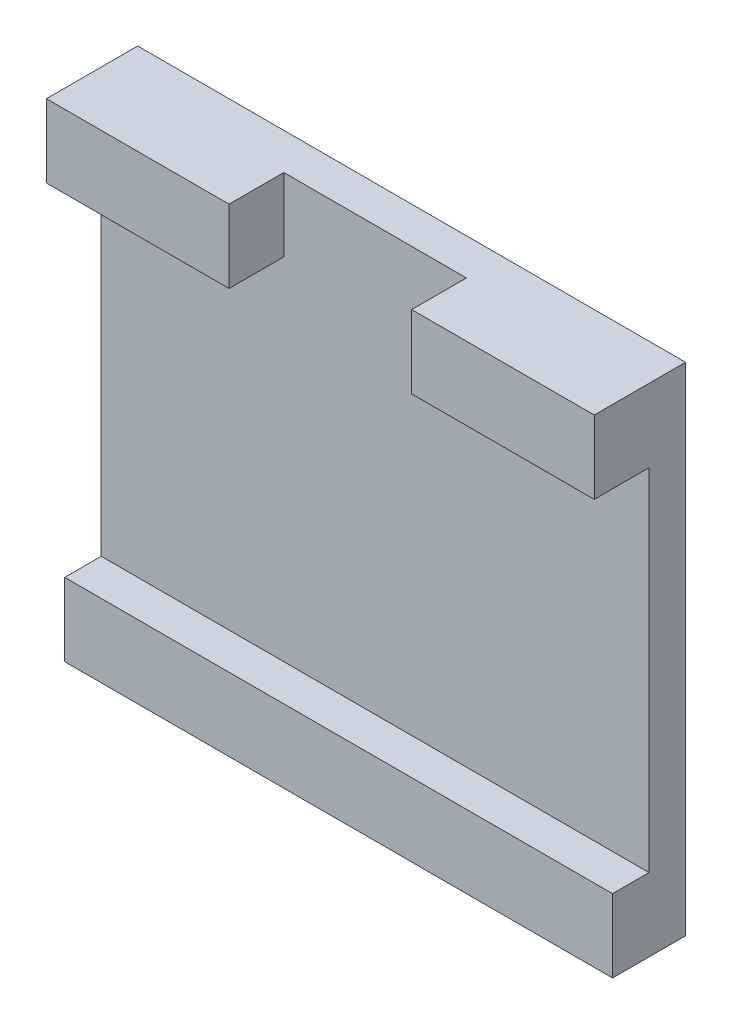
ISO-10303-21;
HEADER;
FILE_DESCRIPTION(('STEP AP214'),'2;1');
FILE_NAME('part.step','',(''),(''),'','','');
FILE_SCHEMA(('AUTOMOTIVE_DESIGN { 1 0 10303 214 1 1 1 1 }'));
ENDSEC;
DATA;
#1=APPLICATION_CONTEXT('core data for automotive mechanical design processes');
#2=APPLICATION_PROTOCOL_DEFINITION('international standard','automotive_design',2000,#1);
#3=PRODUCT_CONTEXT('',#1,'mechanical');
#4=PRODUCT('Part','Part','',(#3));
#5=PRODUCT_RELATED_PRODUCT_CATEGORY('part','',(#4));
#6=PRODUCT_DEFINITION_FORMATION('','',#4);
#7=PRODUCT_DEFINITION_CONTEXT('part definition',#1,'design');
#8=PRODUCT_DEFINITION('design','',#6,#7);
#9=PRODUCT_DEFINITION_SHAPE('','',#8);
#10=(LENGTH_UNIT() NAMED_UNIT(*) SI_UNIT(.MILLI.,.METRE.));
#11=(NAMED_UNIT(*) PLANE_ANGLE_UNIT() SI_UNIT($,.RADIAN.));
#12=(NAMED_UNIT(*) SI_UNIT($,.STERADIAN.) SOLID_ANGLE_UNIT());
#13=UNCERTAINTY_MEASURE_WITH_UNIT(LENGTH_MEASURE(1.E-05),#10,'distance_accuracy_value','');
#14=(GEOMETRIC_REPRESENTATION_CONTEXT(3) GLOBAL_UNCERTAINTY_ASSIGNED_CONTEXT((#13)) GLOBAL_UNIT_ASSIGNED_CONTEXT((#10,
#11,#12)) REPRESENTATION_CONTEXT('',''));
#15=CARTESIAN_POINT('',(0.,0.,0.));
#16=DIRECTION('',(0.,0.,1.));
#17=DIRECTION('',(1.,0.,0.));
#18=AXIS2_PLACEMENT_3D('',#15,#16,#17);
#19=CARTESIAN_POINT('',(0.,23.2,3.));
#20=DIRECTION('',(0.,1.,0.));
#21=DIRECTION('',(-1.,0.,0.));
#22=AXIS2_PLACEMENT_3D('',#19,#20,#21);
#23=PLANE('',#22);
#24=DIRECTION('',(1.,0.,0.));
#25=VECTOR('',#24,1.);
#26=CARTESIAN_POINT('',(0.,23.2,3.));
#27=LINE('',#26,#25);
#28=CARTESIAN_POINT('',(4.99999999999999,23.2,3.));
#29=VERTEX_POINT('',#28);
#30=CARTESIAN_POINT('',(15.,23.2,3.));
#31=VERTEX_POINT('',#30);
#32=EDGE_CURVE('E230',#29,#31,#27,.T.);
#33=ORIENTED_EDGE('',*,*,#32,.F.);
#34=DIRECTION('',(0.,0.,1.));
#35=VECTOR('',#34,1.);
#36=CARTESIAN_POINT('',(4.99999999999999,23.2,0.));
#37=LINE('',#36,#35);
#38=CARTESIAN_POINT('',(4.99999999999999,23.2,0.));
#39=VERTEX_POINT('',#38);
#40=EDGE_CURVE('E132',#39,#29,#37,.T.);
#41=ORIENTED_EDGE('',*,*,#40,.F.);
#42=DIRECTION('',(1.,0.,0.));
#43=VECTOR('',#42,1.);
#44=CARTESIAN_POINT('',(0.,23.2,0.));
#45=LINE('',#44,#43);
#46=CARTESIAN_POINT('',(15.,23.2,0.));
#47=VERTEX_POINT('',#46);
#48=EDGE_CURVE('E163',#39,#47,#45,.T.);
#49=ORIENTED_EDGE('',*,*,#48,.T.);
#50=DIRECTION('',(0.,0.,-1.));
#51=VECTOR('',#50,1.);
#52=CARTESIAN_POINT('',(15.,23.2,3.));
#53=LINE('',#52,#51);
#54=EDGE_CURVE('E154',#31,#47,#53,.T.);
#55=ORIENTED_EDGE('',*,*,#54,.F.);
#56=EDGE_LOOP('',(#33,#41,#49,#55));
#57=FACE_BOUND('',#56,.T.);
#58=ADVANCED_FACE('F35',(#57),#23,.F.);
#59=CARTESIAN_POINT('',(0.,0.,3.));
#60=DIRECTION('',(0.,0.,1.));
#61=DIRECTION('',(1.,0.,0.));
#62=AXIS2_PLACEMENT_3D('',#59,#60,#61);
#63=PLANE('',#62);
#64=DIRECTION('',(0.,-1.,0.));
#65=VECTOR('',#64,1.);
#66=CARTESIAN_POINT('',(4.99999999999999,27.201,3.));
#67=LINE('',#66,#65);
#68=CARTESIAN_POINT('',(4.99999999999999,27.2,3.));
#69=VERTEX_POINT('',#68);
#70=EDGE_CURVE('E126',#69,#29,#67,.T.);
#71=ORIENTED_EDGE('',*,*,#70,.T.);
#72=ORIENTED_EDGE('',*,*,#32,.T.);
#73=DIRECTION('',(0.,1.,0.));
#74=VECTOR('',#73,1.);
#75=CARTESIAN_POINT('',(15.,0.,3.));
#76=LINE('',#75,#74);
#77=CARTESIAN_POINT('',(15.,27.2,3.));
#78=VERTEX_POINT('',#77);
#79=EDGE_CURVE('E150',#31,#78,#76,.T.);
#80=ORIENTED_EDGE('',*,*,#79,.T.);
#81=DIRECTION('',(1.,0.,0.));
#82=VECTOR('',#81,1.);
#83=CARTESIAN_POINT('',(0.,27.2,3.));
#84=LINE('',#83,#82);
#85=EDGE_CURVE('E142',#69,#78,#84,.T.);
#86=ORIENTED_EDGE('',*,*,#85,.F.);
#87=EDGE_LOOP('',(#71,#72,#80,#86));
#88=FACE_BOUND('',#87,.T.);
#89=ADVANCED_FACE('F148',(#88),#63,.T.);
#90=CARTESIAN_POINT('',(0.,0.,0.));
#91=DIRECTION('',(0.,0.,1.));
#92=DIRECTION('',(1.,0.,0.));
#93=AXIS2_PLACEMENT_3D('',#90,#91,#92);
#94=PLANE('',#93);
#95=DIRECTION('',(0.,1.,0.));
#96=VECTOR('',#95,1.);
#97=CARTESIAN_POINT('',(15.,0.,0.));
#98=LINE('',#97,#96);
#99=CARTESIAN_POINT('',(15.,4.,0.));
#100=VERTEX_POINT('',#99);
#101=EDGE_CURVE('E191',#100,#47,#98,.T.);
#102=ORIENTED_EDGE('',*,*,#101,.T.);
#103=ORIENTED_EDGE('',*,*,#48,.F.);
#104=DIRECTION('',(0.,-1.,0.));
#105=VECTOR('',#104,1.);
#106=CARTESIAN_POINT('',(4.99999999999999,27.201,0.));
#107=LINE('',#106,#105);
#108=CARTESIAN_POINT('',(4.99999999999999,27.2,0.));
#109=VERTEX_POINT('',#108);
#110=EDGE_CURVE('E237',#109,#39,#107,.T.);
#111=ORIENTED_EDGE('',*,*,#110,.F.);
#112=DIRECTION('',(-1.,0.,0.));
#113=VECTOR('',#112,1.);
#114=CARTESIAN_POINT('',(-5.00000000000001,27.2,0.));
#115=LINE('',#114,#113);
#116=CARTESIAN_POINT('',(-5.00000000000001,27.2,0.));
#117=VERTEX_POINT('',#116);
#118=EDGE_CURVE('E145',#109,#117,#115,.T.);
#119=ORIENTED_EDGE('',*,*,#118,.T.);
#120=DIRECTION('',(0.,-1.,0.));
#121=VECTOR('',#120,1.);
#122=CARTESIAN_POINT('',(-5.00000000000001,27.201,0.));
#123=LINE('',#122,#121);
#124=CARTESIAN_POINT('',(-5.00000000000001,23.2,0.));
#125=VERTEX_POINT('',#124);
#126=EDGE_CURVE('E222',#117,#125,#123,.T.);
#127=ORIENTED_EDGE('',*,*,#126,.T.);
#128=CARTESIAN_POINT('',(-15.,23.2,0.));
#129=VERTEX_POINT('',#128);
#130=EDGE_CURVE('E159',#129,#125,#45,.T.);
#131=ORIENTED_EDGE('',*,*,#130,.F.);
#132=DIRECTION('',(0.,1.,0.));
#133=VECTOR('',#132,1.);
#134=CARTESIAN_POINT('',(-15.,0.,0.));
#135=LINE('',#134,#133);
#136=CARTESIAN_POINT('',(-15.,4.,0.));
#137=VERTEX_POINT('',#136);
#138=EDGE_CURVE('E186',#137,#129,#135,.T.);
#139=ORIENTED_EDGE('',*,*,#138,.F.);
#140=DIRECTION('',(-1.,0.,0.));
#141=VECTOR('',#140,1.);
#142=CARTESIAN_POINT('',(0.,4.,0.));
#143=LINE('',#142,#141);
#144=EDGE_CURVE('E60',#100,#137,#143,.T.);
#145=ORIENTED_EDGE('',*,*,#144,.F.);
#146=EDGE_LOOP('',(#102,#103,#111,#119,#127,#131,#139,#145));
#147=FACE_BOUND('',#146,.T.);
#148=ADVANCED_FACE('F221',(#147),#94,.T.);
#149=CARTESIAN_POINT('',(-15.,0.,-2.));
#150=DIRECTION('',(1.,0.,0.));
#151=DIRECTION('',(0.,0.,-1.));
#152=AXIS2_PLACEMENT_3D('',#149,#150,#151);
#153=PLANE('',#152);
#154=DIRECTION('',(0.,0.,1.));
#155=VECTOR('',#154,1.);
#156=CARTESIAN_POINT('',(-15.,0.,-2.));
#157=LINE('',#156,#155);
#158=CARTESIAN_POINT('',(-15.,0.,-2.));
#159=VERTEX_POINT('',#158);
#160=CARTESIAN_POINT('',(-15.,0.,2.));
#161=VERTEX_POINT('',#160);
#162=EDGE_CURVE('E39',#159,#161,#157,.T.);
#163=ORIENTED_EDGE('',*,*,#162,.T.);
#164=DIRECTION('',(0.,1.,0.));
#165=VECTOR('',#164,1.);
#166=CARTESIAN_POINT('',(-15.,0.,2.));
#167=LINE('',#166,#165);
#168=CARTESIAN_POINT('',(-15.,4.,2.));
#169=VERTEX_POINT('',#168);
#170=EDGE_CURVE('E173',#161,#169,#167,.T.);
#171=ORIENTED_EDGE('',*,*,#170,.T.);
#172=DIRECTION('',(0.,0.,-1.));
#173=VECTOR('',#172,1.);
#174=CARTESIAN_POINT('',(-15.,4.,2.));
#175=LINE('',#174,#173);
#176=EDGE_CURVE('E179',#169,#137,#175,.T.);
#177=ORIENTED_EDGE('',*,*,#176,.T.);
#178=ORIENTED_EDGE('',*,*,#138,.T.);
#179=DIRECTION('',(0.,0.,-1.));
#180=VECTOR('',#179,1.);
#181=CARTESIAN_POINT('',(-15.,23.2,3.));
#182=LINE('',#181,#180);
#183=CARTESIAN_POINT('',(-15.,23.2,3.));
#184=VERTEX_POINT('',#183);
#185=EDGE_CURVE('E166',#184,#129,#182,.T.);
#186=ORIENTED_EDGE('',*,*,#185,.F.);
#187=DIRECTION('',(0.,1.,0.));
#188=VECTOR('',#187,1.);
#189=CARTESIAN_POINT('',(-15.,0.,3.));
#190=LINE('',#189,#188);
#191=CARTESIAN_POINT('',(-15.,27.2,3.));
#192=VERTEX_POINT('',#191);
#193=EDGE_CURVE('E162',#184,#192,#190,.T.);
#194=ORIENTED_EDGE('',*,*,#193,.T.);
#195=DIRECTION('',(0.,0.,1.));
#196=VECTOR('',#195,1.);
#197=CARTESIAN_POINT('',(-15.,27.2,-2.));
#198=LINE('',#197,#196);
#199=CARTESIAN_POINT('',(-15.,27.2,-2.));
#200=VERTEX_POINT('',#199);
#201=EDGE_CURVE('E11',#200,#192,#198,.T.);
#202=ORIENTED_EDGE('',*,*,#201,.F.);
#203=DIRECTION('',(0.,1.,0.));
#204=VECTOR('',#203,1.);
#205=CARTESIAN_POINT('',(-15.,0.,-2.));
#206=LINE('',#205,#204);
#207=EDGE_CURVE('E187',#159,#200,#206,.T.);
#208=ORIENTED_EDGE('',*,*,#207,.F.);
#209=EDGE_LOOP('',(#163,#171,#177,#178,#186,#194,#202,#208));
#210=FACE_BOUND('',#209,.T.);
#211=ADVANCED_FACE('F37',(#210),#153,.F.);
#212=CARTESIAN_POINT('',(0.,27.2,-2.));
#213=DIRECTION('',(0.,-1.,0.));
#214=DIRECTION('',(1.,0.,0.));
#215=AXIS2_PLACEMENT_3D('',#212,#213,#214);
#216=PLANE('',#215);
#217=ORIENTED_EDGE('',*,*,#118,.F.);
#218=DIRECTION('',(0.,0.,-1.));
#219=VECTOR('',#218,1.);
#220=CARTESIAN_POINT('',(4.99999999999999,27.2,0.));
#221=LINE('',#220,#219);
#222=EDGE_CURVE('E129',#69,#109,#221,.T.);
#223=ORIENTED_EDGE('',*,*,#222,.F.);
#224=ORIENTED_EDGE('',*,*,#85,.T.);
#225=DIRECTION('',(0.,0.,1.));
#226=VECTOR('',#225,1.);
#227=CARTESIAN_POINT('',(15.,27.2,-2.));
#228=LINE('',#227,#226);
#229=CARTESIAN_POINT('',(15.,27.2,-2.));
#230=VERTEX_POINT('',#229);
#231=EDGE_CURVE('E44',#230,#78,#228,.T.);
#232=ORIENTED_EDGE('',*,*,#231,.F.);
#233=DIRECTION('',(1.,0.,0.));
#234=VECTOR('',#233,1.);
#235=CARTESIAN_POINT('',(0.,27.2,-2.));
#236=LINE('',#235,#234);
#237=EDGE_CURVE('E197',#200,#230,#236,.T.);
#238=ORIENTED_EDGE('',*,*,#237,.F.);
#239=ORIENTED_EDGE('',*,*,#201,.T.);
#240=CARTESIAN_POINT('',(-5.00000000000001,27.2,3.));
#241=VERTEX_POINT('',#240);
#242=EDGE_CURVE('E151',#192,#241,#84,.T.);
#243=ORIENTED_EDGE('',*,*,#242,.T.);
#244=DIRECTION('',(0.,0.,1.));
#245=VECTOR('',#244,1.);
#246=CARTESIAN_POINT('',(-5.00000000000001,27.2,0.));
#247=LINE('',#246,#245);
#248=EDGE_CURVE('E52',#117,#241,#247,.T.);
#249=ORIENTED_EDGE('',*,*,#248,.F.);
#250=EDGE_LOOP('',(#217,#223,#224,#232,#238,#239,#243,#249));
#251=FACE_BOUND('',#250,.T.);
#252=ADVANCED_FACE('F140',(#251),#216,.F.);
#253=CARTESIAN_POINT('',(15.,0.,-2.));
#254=DIRECTION('',(1.,0.,0.));
#255=DIRECTION('',(0.,1.,0.));
#256=AXIS2_PLACEMENT_3D('',#253,#254,#255);
#257=PLANE('',#256);
#258=ORIENTED_EDGE('',*,*,#101,.F.);
#259=DIRECTION('',(0.,0.,-1.));
#260=VECTOR('',#259,1.);
#261=CARTESIAN_POINT('',(15.,4.,2.));
#262=LINE('',#261,#260);
#263=CARTESIAN_POINT('',(15.,4.,2.));
#264=VERTEX_POINT('',#263);
#265=EDGE_CURVE('E183',#264,#100,#262,.T.);
#266=ORIENTED_EDGE('',*,*,#265,.F.);
#267=DIRECTION('',(0.,1.,0.));
#268=VECTOR('',#267,1.);
#269=CARTESIAN_POINT('',(15.,0.,2.));
#270=LINE('',#269,#268);
#271=CARTESIAN_POINT('',(15.,0.,2.));
#272=VERTEX_POINT('',#271);
#273=EDGE_CURVE('E168',#272,#264,#270,.T.);
#274=ORIENTED_EDGE('',*,*,#273,.F.);
#275=DIRECTION('',(0.,0.,1.));
#276=VECTOR('',#275,1.);
#277=CARTESIAN_POINT('',(15.,0.,-2.));
#278=LINE('',#277,#276);
#279=CARTESIAN_POINT('',(15.,0.,-2.));
#280=VERTEX_POINT('',#279);
#281=EDGE_CURVE('E202',#280,#272,#278,.T.);
#282=ORIENTED_EDGE('',*,*,#281,.F.);
#283=DIRECTION('',(0.,1.,0.));
#284=VECTOR('',#283,1.);
#285=CARTESIAN_POINT('',(15.,0.,-2.));
#286=LINE('',#285,#284);
#287=EDGE_CURVE('E194',#280,#230,#286,.T.);
#288=ORIENTED_EDGE('',*,*,#287,.T.);
#289=ORIENTED_EDGE('',*,*,#231,.T.);
#290=ORIENTED_EDGE('',*,*,#79,.F.);
#291=ORIENTED_EDGE('',*,*,#54,.T.);
#292=EDGE_LOOP('',(#258,#266,#274,#282,#288,#289,#290,#291));
#293=FACE_BOUND('',#292,.T.);
#294=ADVANCED_FACE('F247',(#293),#257,.T.);
#295=CARTESIAN_POINT('',(0.,0.,-2.));
#296=DIRECTION('',(0.,-1.,0.));
#297=DIRECTION('',(1.,0.,0.));
#298=AXIS2_PLACEMENT_3D('',#295,#296,#297);
#299=PLANE('',#298);
#300=ORIENTED_EDGE('',*,*,#281,.T.);
#301=DIRECTION('',(1.,0.,0.));
#302=VECTOR('',#301,1.);
#303=CARTESIAN_POINT('',(0.,0.,2.));
#304=LINE('',#303,#302);
#305=EDGE_CURVE('E176',#161,#272,#304,.T.);
#306=ORIENTED_EDGE('',*,*,#305,.F.);
#307=ORIENTED_EDGE('',*,*,#162,.F.);
#308=DIRECTION('',(1.,0.,0.));
#309=VECTOR('',#308,1.);
#310=CARTESIAN_POINT('',(0.,0.,-2.));
#311=LINE('',#310,#309);
#312=EDGE_CURVE('E190',#159,#280,#311,.T.);
#313=ORIENTED_EDGE('',*,*,#312,.T.);
#314=EDGE_LOOP('',(#300,#306,#307,#313));
#315=FACE_BOUND('',#314,.T.);
#316=ADVANCED_FACE('F210',(#315),#299,.T.);
#317=CARTESIAN_POINT('',(0.,0.,-2.));
#318=DIRECTION('',(0.,0.,1.));
#319=DIRECTION('',(1.,0.,0.));
#320=AXIS2_PLACEMENT_3D('',#317,#318,#319);
#321=PLANE('',#320);
#322=ORIENTED_EDGE('',*,*,#207,.T.);
#323=ORIENTED_EDGE('',*,*,#237,.T.);
#324=ORIENTED_EDGE('',*,*,#287,.F.);
#325=ORIENTED_EDGE('',*,*,#312,.F.);
#326=EDGE_LOOP('',(#322,#323,#324,#325));
#327=FACE_BOUND('',#326,.T.);
#328=ADVANCED_FACE('F245',(#327),#321,.F.);
#329=CARTESIAN_POINT('',(0.,4.,2.));
#330=DIRECTION('',(0.,-1.,0.));
#331=DIRECTION('',(1.,0.,0.));
#332=AXIS2_PLACEMENT_3D('',#329,#330,#331);
#333=PLANE('',#332);
#334=ORIENTED_EDGE('',*,*,#144,.T.);
#335=ORIENTED_EDGE('',*,*,#176,.F.);
#336=DIRECTION('',(-1.,0.,0.));
#337=VECTOR('',#336,1.);
#338=CARTESIAN_POINT('',(0.,4.,2.));
#339=LINE('',#338,#337);
#340=EDGE_CURVE('E171',#264,#169,#339,.T.);
#341=ORIENTED_EDGE('',*,*,#340,.F.);
#342=ORIENTED_EDGE('',*,*,#265,.T.);
#343=EDGE_LOOP('',(#334,#335,#341,#342));
#344=FACE_BOUND('',#343,.T.);
#345=ADVANCED_FACE('F217',(#344),#333,.F.);
#346=CARTESIAN_POINT('',(0.,0.,2.));
#347=DIRECTION('',(0.,0.,1.));
#348=DIRECTION('',(1.,0.,0.));
#349=AXIS2_PLACEMENT_3D('',#346,#347,#348);
#350=PLANE('',#349);
#351=ORIENTED_EDGE('',*,*,#273,.T.);
#352=ORIENTED_EDGE('',*,*,#340,.T.);
#353=ORIENTED_EDGE('',*,*,#170,.F.);
#354=ORIENTED_EDGE('',*,*,#305,.T.);
#355=EDGE_LOOP('',(#351,#352,#353,#354));
#356=FACE_BOUND('',#355,.T.);
#357=ADVANCED_FACE('F213',(#356),#350,.T.);
#358=ORIENTED_EDGE('',*,*,#130,.T.);
#359=DIRECTION('',(0.,0.,-1.));
#360=VECTOR('',#359,1.);
#361=CARTESIAN_POINT('',(-5.00000000000001,23.2,0.));
#362=LINE('',#361,#360);
#363=CARTESIAN_POINT('',(-5.00000000000001,23.2,3.));
#364=VERTEX_POINT('',#363);
#365=EDGE_CURVE('E137',#364,#125,#362,.T.);
#366=ORIENTED_EDGE('',*,*,#365,.F.);
#367=EDGE_CURVE('E155',#184,#364,#27,.T.);
#368=ORIENTED_EDGE('',*,*,#367,.F.);
#369=ORIENTED_EDGE('',*,*,#185,.T.);
#370=EDGE_LOOP('',(#358,#366,#368,#369));
#371=FACE_BOUND('',#370,.T.);
#372=ADVANCED_FACE('F226',(#371),#23,.F.);
#373=DIRECTION('',(0.,-1.,0.));
#374=VECTOR('',#373,1.);
#375=CARTESIAN_POINT('',(-5.00000000000001,27.201,3.));
#376=LINE('',#375,#374);
#377=EDGE_CURVE('E136',#241,#364,#376,.T.);
#378=ORIENTED_EDGE('',*,*,#377,.F.);
#379=ORIENTED_EDGE('',*,*,#242,.F.);
#380=ORIENTED_EDGE('',*,*,#193,.F.);
#381=ORIENTED_EDGE('',*,*,#367,.T.);
#382=EDGE_LOOP('',(#378,#379,#380,#381));
#383=FACE_BOUND('',#382,.T.);
#384=ADVANCED_FACE('F232',(#383),#63,.T.);
#385=CARTESIAN_POINT('',(4.99999999999999,27.201,0.));
#386=DIRECTION('',(1.,0.,0.));
#387=DIRECTION('',(0.,1.,0.));
#388=AXIS2_PLACEMENT_3D('',#385,#386,#387);
#389=PLANE('',#388);
#390=ORIENTED_EDGE('',*,*,#222,.T.);
#391=ORIENTED_EDGE('',*,*,#110,.T.);
#392=ORIENTED_EDGE('',*,*,#40,.T.);
#393=ORIENTED_EDGE('',*,*,#70,.F.);
#394=EDGE_LOOP('',(#390,#391,#392,#393));
#395=FACE_BOUND('',#394,.T.);
#396=ADVANCED_FACE('F128',(#395),#389,.F.);
#397=CARTESIAN_POINT('',(-5.00000000000001,27.201,0.));
#398=DIRECTION('',(-1.,0.,0.));
#399=DIRECTION('',(0.,-1.,0.));
#400=AXIS2_PLACEMENT_3D('',#397,#398,#399);
#401=PLANE('',#400);
#402=ORIENTED_EDGE('',*,*,#248,.T.);
#403=ORIENTED_EDGE('',*,*,#377,.T.);
#404=ORIENTED_EDGE('',*,*,#365,.T.);
#405=ORIENTED_EDGE('',*,*,#126,.F.);
#406=EDGE_LOOP('',(#402,#403,#404,#405));
#407=FACE_BOUND('',#406,.T.);
#408=ADVANCED_FACE('F348',(#407),#401,.F.);
#409=CLOSED_SHELL('',(#58,#89,#148,#211,#252,#294,#316,#328,#345,#357,#372,#384,#396,#408));
#410=MANIFOLD_SOLID_BREP('B2',#409);
#411=ADVANCED_BREP_SHAPE_REPRESENTATION('',(#18,#410),#14);
#412=SHAPE_DEFINITION_REPRESENTATION(#9,#411);
ENDSEC;
END-ISO-10303-21;
